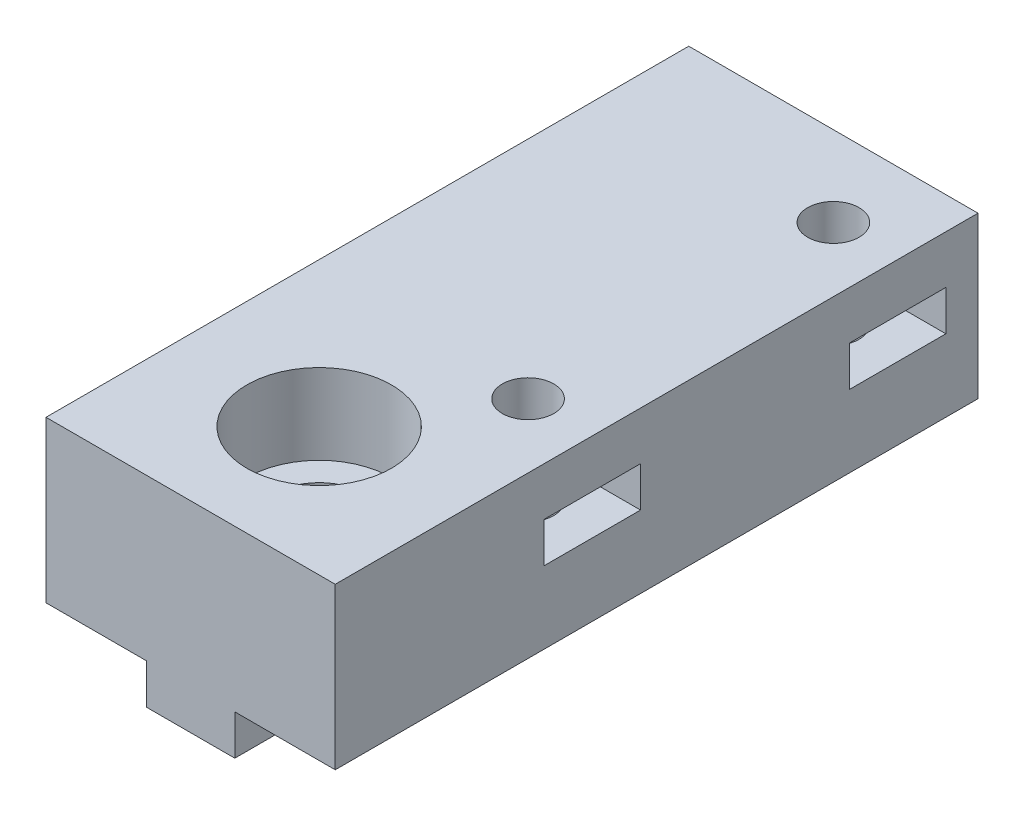
ISO-10303-21;
HEADER;
FILE_DESCRIPTION(('STEP AP214'),'2;1');
FILE_NAME('part.step','',(''),(''),'','','');
FILE_SCHEMA(('AUTOMOTIVE_DESIGN { 1 0 10303 214 1 1 1 1 }'));
ENDSEC;
DATA;
#1=APPLICATION_CONTEXT('core data for automotive mechanical design processes');
#2=APPLICATION_PROTOCOL_DEFINITION('international standard','automotive_design',2000,#1);
#3=PRODUCT_CONTEXT('',#1,'mechanical');
#4=PRODUCT('Part','Part','',(#3));
#5=PRODUCT_RELATED_PRODUCT_CATEGORY('part','',(#4));
#6=PRODUCT_DEFINITION_FORMATION('','',#4);
#7=PRODUCT_DEFINITION_CONTEXT('part definition',#1,'design');
#8=PRODUCT_DEFINITION('design','',#6,#7);
#9=PRODUCT_DEFINITION_SHAPE('','',#8);
#10=(LENGTH_UNIT() NAMED_UNIT(*) SI_UNIT(.MILLI.,.METRE.));
#11=(NAMED_UNIT(*) PLANE_ANGLE_UNIT() SI_UNIT($,.RADIAN.));
#12=(NAMED_UNIT(*) SI_UNIT($,.STERADIAN.) SOLID_ANGLE_UNIT());
#13=UNCERTAINTY_MEASURE_WITH_UNIT(LENGTH_MEASURE(1.E-05),#10,'distance_accuracy_value','');
#14=(GEOMETRIC_REPRESENTATION_CONTEXT(3) GLOBAL_UNCERTAINTY_ASSIGNED_CONTEXT((#13)) GLOBAL_UNIT_ASSIGNED_CONTEXT((#10,
#11,#12)) REPRESENTATION_CONTEXT('',''));
#15=CARTESIAN_POINT('',(0.,0.,0.));
#16=DIRECTION('',(0.,0.,1.));
#17=DIRECTION('',(1.,0.,0.));
#18=AXIS2_PLACEMENT_3D('',#15,#16,#17);
#19=CARTESIAN_POINT('',(13.3032417795605,-2.5,-35.));
#20=DIRECTION('',(0.,1.,0.));
#21=DIRECTION('',(0.,0.,1.));
#22=AXIS2_PLACEMENT_3D('',#19,#20,#21);
#23=CYLINDRICAL_SURFACE('',#22,1.6);
#24=CARTESIAN_POINT('',(13.3032417795605,7.,-35.));
#25=DIRECTION('',(0.,1.,0.));
#26=DIRECTION('',(0.,0.,1.));
#27=AXIS2_PLACEMENT_3D('',#24,#25,#26);
#28=CIRCLE('',#27,1.6);
#29=CARTESIAN_POINT('',(13.3032417795605,7.,-33.4));
#30=VERTEX_POINT('',#29);
#31=EDGE_CURVE('E37',#30,#30,#28,.F.);
#32=ORIENTED_EDGE('',*,*,#31,.T.);
#33=EDGE_LOOP('',(#32));
#34=FACE_BOUND('',#33,.T.);
#35=CARTESIAN_POINT('',(13.3032417795605,10.,-35.));
#36=DIRECTION('',(0.,1.,0.));
#37=DIRECTION('',(0.,0.,1.));
#38=AXIS2_PLACEMENT_3D('',#35,#36,#37);
#39=CIRCLE('',#38,1.6);
#40=CARTESIAN_POINT('',(13.3032417795605,10.,-33.4));
#41=VERTEX_POINT('',#40);
#42=EDGE_CURVE('E243',#41,#41,#39,.T.);
#43=ORIENTED_EDGE('',*,*,#42,.T.);
#44=EDGE_LOOP('',(#43));
#45=FACE_BOUND('',#44,.T.);
#46=ADVANCED_FACE('F33',(#34,#45),#23,.F.);
#47=CARTESIAN_POINT('',(13.3032417795605,-2.5,-16.));
#48=DIRECTION('',(0.,1.,0.));
#49=DIRECTION('',(0.,0.,1.));
#50=AXIS2_PLACEMENT_3D('',#47,#48,#49);
#51=CYLINDRICAL_SURFACE('',#50,1.6);
#52=CARTESIAN_POINT('',(13.3032417795605,7.,-16.));
#53=DIRECTION('',(0.,1.,0.));
#54=DIRECTION('',(0.,0.,1.));
#55=AXIS2_PLACEMENT_3D('',#52,#53,#54);
#56=CIRCLE('',#55,1.6);
#57=CARTESIAN_POINT('',(13.3032417795605,7.,-14.4));
#58=VERTEX_POINT('',#57);
#59=EDGE_CURVE('E247',#58,#58,#56,.F.);
#60=ORIENTED_EDGE('',*,*,#59,.T.);
#61=EDGE_LOOP('',(#60));
#62=FACE_BOUND('',#61,.T.);
#63=CARTESIAN_POINT('',(13.3032417795605,10.,-16.));
#64=DIRECTION('',(0.,1.,0.));
#65=DIRECTION('',(0.,0.,1.));
#66=AXIS2_PLACEMENT_3D('',#63,#64,#65);
#67=CIRCLE('',#66,1.6);
#68=CARTESIAN_POINT('',(13.3032417795605,10.,-14.4));
#69=VERTEX_POINT('',#68);
#70=EDGE_CURVE('E248',#69,#69,#67,.T.);
#71=ORIENTED_EDGE('',*,*,#70,.T.);
#72=EDGE_LOOP('',(#71));
#73=FACE_BOUND('',#72,.T.);
#74=ADVANCED_FACE('F375',(#62,#73),#51,.F.);
#75=CARTESIAN_POINT('',(8.30324177956045,-2.5,-8.));
#76=DIRECTION('',(0.,1.,0.));
#77=DIRECTION('',(0.,0.,1.));
#78=AXIS2_PLACEMENT_3D('',#75,#76,#77);
#79=CYLINDRICAL_SURFACE('',#78,2.8);
#80=CARTESIAN_POINT('',(8.30324177956045,-2.5,-8.));
#81=DIRECTION('',(0.,1.,0.));
#82=DIRECTION('',(0.,0.,1.));
#83=AXIS2_PLACEMENT_3D('',#80,#81,#82);
#84=CIRCLE('',#83,2.8);
#85=CARTESIAN_POINT('',(11.0532417795605,-2.5,-8.52678268764264));
#86=VERTEX_POINT('',#85);
#87=CARTESIAN_POINT('',(5.55324177956045,-2.5,-8.52678268764265));
#88=VERTEX_POINT('',#87);
#89=EDGE_CURVE('E11',#86,#88,#84,.T.);
#90=ORIENTED_EDGE('',*,*,#89,.F.);
#91=DIRECTION('',(0.,1.,0.));
#92=VECTOR('',#91,1.);
#93=CARTESIAN_POINT('',(11.0532417795605,-2.5,-8.52678268764264));
#94=LINE('',#93,#92);
#95=CARTESIAN_POINT('',(11.0532417795605,0.,-8.52678268764264));
#96=VERTEX_POINT('',#95);
#97=EDGE_CURVE('E259',#96,#86,#94,.F.);
#98=ORIENTED_EDGE('',*,*,#97,.F.);
#99=CARTESIAN_POINT('',(8.30324177956045,0.,-8.));
#100=DIRECTION('',(0.,-1.,0.));
#101=DIRECTION('',(0.,0.,-1.));
#102=AXIS2_PLACEMENT_3D('',#99,#100,#101);
#103=CIRCLE('',#102,2.8);
#104=CARTESIAN_POINT('',(11.0532417795605,0.,-7.47321731235736));
#105=VERTEX_POINT('',#104);
#106=EDGE_CURVE('E262',#96,#105,#103,.T.);
#107=ORIENTED_EDGE('',*,*,#106,.T.);
#108=DIRECTION('',(0.,1.,0.));
#109=VECTOR('',#108,1.);
#110=CARTESIAN_POINT('',(11.0532417795605,-2.5,-7.47321731235736));
#111=LINE('',#110,#109);
#112=CARTESIAN_POINT('',(11.0532417795605,-2.5,-7.47321731235736));
#113=VERTEX_POINT('',#112);
#114=EDGE_CURVE('E264',#113,#105,#111,.T.);
#115=ORIENTED_EDGE('',*,*,#114,.F.);
#116=CARTESIAN_POINT('',(5.55324177956045,-2.5,-7.47321731235736));
#117=VERTEX_POINT('',#116);
#118=EDGE_CURVE('E42',#117,#113,#84,.T.);
#119=ORIENTED_EDGE('',*,*,#118,.F.);
#120=DIRECTION('',(0.,1.,0.));
#121=VECTOR('',#120,1.);
#122=CARTESIAN_POINT('',(5.55324177956045,-2.5,-7.47321731235736));
#123=LINE('',#122,#121);
#124=CARTESIAN_POINT('',(5.55324177956045,0.,-7.47321731235736));
#125=VERTEX_POINT('',#124);
#126=EDGE_CURVE('E267',#125,#117,#123,.F.);
#127=ORIENTED_EDGE('',*,*,#126,.F.);
#128=CARTESIAN_POINT('',(8.30324177956045,0.,-8.));
#129=DIRECTION('',(0.,-1.,0.));
#130=DIRECTION('',(0.,0.,-1.));
#131=AXIS2_PLACEMENT_3D('',#128,#129,#130);
#132=CIRCLE('',#131,2.8);
#133=CARTESIAN_POINT('',(5.55324177956045,0.,-8.52678268764265));
#134=VERTEX_POINT('',#133);
#135=EDGE_CURVE('E270',#125,#134,#132,.T.);
#136=ORIENTED_EDGE('',*,*,#135,.T.);
#137=DIRECTION('',(0.,1.,0.));
#138=VECTOR('',#137,1.);
#139=CARTESIAN_POINT('',(5.55324177956045,-2.5,-8.52678268764265));
#140=LINE('',#139,#138);
#141=EDGE_CURVE('E272',#88,#134,#140,.T.);
#142=ORIENTED_EDGE('',*,*,#141,.F.);
#143=EDGE_LOOP('',(#90,#98,#107,#115,#119,#127,#136,#142));
#144=FACE_BOUND('',#143,.T.);
#145=CARTESIAN_POINT('',(8.30324177956045,5.,-8.));
#146=DIRECTION('',(0.,1.,0.));
#147=DIRECTION('',(0.,0.,1.));
#148=AXIS2_PLACEMENT_3D('',#145,#146,#147);
#149=CIRCLE('',#148,2.8);
#150=CARTESIAN_POINT('',(8.30324177956045,5.,-5.2));
#151=VERTEX_POINT('',#150);
#152=EDGE_CURVE('E255',#151,#151,#149,.F.);
#153=ORIENTED_EDGE('',*,*,#152,.F.);
#154=EDGE_LOOP('',(#153));
#155=FACE_BOUND('',#154,.T.);
#156=ADVANCED_FACE('F381',(#144,#155),#79,.F.);
#157=CARTESIAN_POINT('',(5.55324177956045,-2.5,-40.));
#158=DIRECTION('',(1.,0.,0.));
#159=DIRECTION('',(0.,0.,-1.));
#160=AXIS2_PLACEMENT_3D('',#157,#158,#159);
#161=PLANE('',#160);
#162=DIRECTION('',(0.,0.,-1.));
#163=VECTOR('',#162,1.);
#164=CARTESIAN_POINT('',(5.55324177956045,-2.5,-40.));
#165=LINE('',#164,#163);
#166=CARTESIAN_POINT('',(5.55324177956045,-2.5,-40.));
#167=VERTEX_POINT('',#166);
#168=EDGE_CURVE('E280',#88,#167,#165,.T.);
#169=ORIENTED_EDGE('',*,*,#168,.F.);
#170=ORIENTED_EDGE('',*,*,#141,.T.);
#171=DIRECTION('',(0.,0.,-1.));
#172=VECTOR('',#171,1.);
#173=CARTESIAN_POINT('',(5.55324177956045,0.,-40.));
#174=LINE('',#173,#172);
#175=CARTESIAN_POINT('',(5.55324177956045,0.,-40.));
#176=VERTEX_POINT('',#175);
#177=EDGE_CURVE('E275',#134,#176,#174,.T.);
#178=ORIENTED_EDGE('',*,*,#177,.T.);
#179=DIRECTION('',(0.,1.,0.));
#180=VECTOR('',#179,1.);
#181=CARTESIAN_POINT('',(5.55324177956045,-2.5,-40.));
#182=LINE('',#181,#180);
#183=EDGE_CURVE('E304',#167,#176,#182,.T.);
#184=ORIENTED_EDGE('',*,*,#183,.F.);
#185=EDGE_LOOP('',(#169,#170,#178,#184));
#186=FACE_BOUND('',#185,.T.);
#187=ADVANCED_FACE('F449',(#186),#161,.F.);
#188=CARTESIAN_POINT('',(11.0532417795605,-2.5,-40.));
#189=DIRECTION('',(-1.,0.,0.));
#190=DIRECTION('',(0.,0.,1.));
#191=AXIS2_PLACEMENT_3D('',#188,#189,#190);
#192=PLANE('',#191);
#193=DIRECTION('',(0.,0.,1.));
#194=VECTOR('',#193,1.);
#195=CARTESIAN_POINT('',(11.0532417795605,-2.5,-40.));
#196=LINE('',#195,#194);
#197=CARTESIAN_POINT('',(11.0532417795605,-2.5,0.));
#198=VERTEX_POINT('',#197);
#199=EDGE_CURVE('E282',#113,#198,#196,.T.);
#200=ORIENTED_EDGE('',*,*,#199,.F.);
#201=ORIENTED_EDGE('',*,*,#114,.T.);
#202=DIRECTION('',(0.,0.,1.));
#203=VECTOR('',#202,1.);
#204=CARTESIAN_POINT('',(11.0532417795605,0.,-40.));
#205=LINE('',#204,#203);
#206=CARTESIAN_POINT('',(11.0532417795605,0.,0.));
#207=VERTEX_POINT('',#206);
#208=EDGE_CURVE('E292',#105,#207,#205,.T.);
#209=ORIENTED_EDGE('',*,*,#208,.T.);
#210=DIRECTION('',(0.,1.,0.));
#211=VECTOR('',#210,1.);
#212=CARTESIAN_POINT('',(11.0532417795605,-2.5,0.));
#213=LINE('',#212,#211);
#214=EDGE_CURVE('E298',#198,#207,#213,.T.);
#215=ORIENTED_EDGE('',*,*,#214,.F.);
#216=EDGE_LOOP('',(#200,#201,#209,#215));
#217=FACE_BOUND('',#216,.T.);
#218=ADVANCED_FACE('F436',(#217),#192,.F.);
#219=CARTESIAN_POINT('',(0.,-2.5,0.));
#220=DIRECTION('',(0.,1.,0.));
#221=DIRECTION('',(0.,0.,1.));
#222=AXIS2_PLACEMENT_3D('',#219,#220,#221);
#223=PLANE('',#222);
#224=CARTESIAN_POINT('',(11.0532417795605,-2.5,-40.));
#225=VERTEX_POINT('',#224);
#226=EDGE_CURVE('E283',#225,#86,#196,.T.);
#227=ORIENTED_EDGE('',*,*,#226,.T.);
#228=ORIENTED_EDGE('',*,*,#89,.T.);
#229=ORIENTED_EDGE('',*,*,#168,.T.);
#230=DIRECTION('',(1.,0.,0.));
#231=VECTOR('',#230,1.);
#232=CARTESIAN_POINT('',(5.55324177956045,-2.5,-40.));
#233=LINE('',#232,#231);
#234=EDGE_CURVE('E279',#167,#225,#233,.T.);
#235=ORIENTED_EDGE('',*,*,#234,.T.);
#236=EDGE_LOOP('',(#227,#228,#229,#235));
#237=FACE_BOUND('',#236,.T.);
#238=ADVANCED_FACE('F451',(#237),#223,.F.);
#239=CARTESIAN_POINT('',(0.,0.,0.));
#240=DIRECTION('',(0.,-1.,0.));
#241=DIRECTION('',(0.,0.,-1.));
#242=AXIS2_PLACEMENT_3D('',#239,#240,#241);
#243=PLANE('',#242);
#244=ORIENTED_EDGE('',*,*,#135,.F.);
#245=CARTESIAN_POINT('',(5.55324177956045,0.,0.));
#246=VERTEX_POINT('',#245);
#247=EDGE_CURVE('E289',#246,#125,#174,.T.);
#248=ORIENTED_EDGE('',*,*,#247,.F.);
#249=DIRECTION('',(1.,0.,0.));
#250=VECTOR('',#249,1.);
#251=CARTESIAN_POINT('',(-0.696758220439547,0.,0.));
#252=LINE('',#251,#250);
#253=CARTESIAN_POINT('',(-0.696758220439547,0.,0.));
#254=VERTEX_POINT('',#253);
#255=EDGE_CURVE('E322',#254,#246,#252,.T.);
#256=ORIENTED_EDGE('',*,*,#255,.F.);
#257=DIRECTION('',(0.,0.,1.));
#258=VECTOR('',#257,1.);
#259=CARTESIAN_POINT('',(-0.696758220439547,0.,0.));
#260=LINE('',#259,#258);
#261=CARTESIAN_POINT('',(-0.696758220439547,0.,-40.));
#262=VERTEX_POINT('',#261);
#263=EDGE_CURVE('E307',#262,#254,#260,.T.);
#264=ORIENTED_EDGE('',*,*,#263,.F.);
#265=DIRECTION('',(-1.,0.,0.));
#266=VECTOR('',#265,1.);
#267=CARTESIAN_POINT('',(-0.696758220439547,0.,-40.));
#268=LINE('',#267,#266);
#269=EDGE_CURVE('E327',#176,#262,#268,.T.);
#270=ORIENTED_EDGE('',*,*,#269,.F.);
#271=ORIENTED_EDGE('',*,*,#177,.F.);
#272=EDGE_LOOP('',(#244,#248,#256,#264,#270,#271));
#273=FACE_BOUND('',#272,.T.);
#274=ADVANCED_FACE('F406',(#273),#243,.T.);
#275=CARTESIAN_POINT('',(-0.696758220439547,10.,0.));
#276=DIRECTION('',(1.,0.,0.));
#277=DIRECTION('',(0.,0.,-1.));
#278=AXIS2_PLACEMENT_3D('',#275,#276,#277);
#279=PLANE('',#278);
#280=ORIENTED_EDGE('',*,*,#263,.T.);
#281=DIRECTION('',(0.,-1.,0.));
#282=VECTOR('',#281,1.);
#283=CARTESIAN_POINT('',(-0.696758220439547,10.,0.));
#284=LINE('',#283,#282);
#285=CARTESIAN_POINT('',(-0.696758220439547,10.,0.));
#286=VERTEX_POINT('',#285);
#287=EDGE_CURVE('E338',#286,#254,#284,.T.);
#288=ORIENTED_EDGE('',*,*,#287,.F.);
#289=DIRECTION('',(0.,0.,1.));
#290=VECTOR('',#289,1.);
#291=CARTESIAN_POINT('',(-0.696758220439547,10.,0.));
#292=LINE('',#291,#290);
#293=CARTESIAN_POINT('',(-0.696758220439547,10.,-40.));
#294=VERTEX_POINT('',#293);
#295=EDGE_CURVE('E308',#294,#286,#292,.T.);
#296=ORIENTED_EDGE('',*,*,#295,.F.);
#297=DIRECTION('',(0.,-1.,0.));
#298=VECTOR('',#297,1.);
#299=CARTESIAN_POINT('',(-0.696758220439547,10.,-40.));
#300=LINE('',#299,#298);
#301=EDGE_CURVE('E318',#294,#262,#300,.T.);
#302=ORIENTED_EDGE('',*,*,#301,.T.);
#303=EDGE_LOOP('',(#280,#288,#296,#302));
#304=FACE_BOUND('',#303,.T.);
#305=ADVANCED_FACE('F35',(#304),#279,.F.);
#306=CARTESIAN_POINT('',(-0.696758220439547,10.,0.));
#307=DIRECTION('',(0.,0.,-1.));
#308=DIRECTION('',(-1.,0.,0.));
#309=AXIS2_PLACEMENT_3D('',#306,#307,#308);
#310=PLANE('',#309);
#311=ORIENTED_EDGE('',*,*,#255,.T.);
#312=DIRECTION('',(0.,1.,0.));
#313=VECTOR('',#312,1.);
#314=CARTESIAN_POINT('',(5.55324177956045,-2.5,0.));
#315=LINE('',#314,#313);
#316=CARTESIAN_POINT('',(5.55324177956045,-2.5,0.));
#317=VERTEX_POINT('',#316);
#318=EDGE_CURVE('E288',#317,#246,#315,.T.);
#319=ORIENTED_EDGE('',*,*,#318,.F.);
#320=DIRECTION('',(-1.,0.,0.));
#321=VECTOR('',#320,1.);
#322=CARTESIAN_POINT('',(5.55324177956045,-2.5,0.));
#323=LINE('',#322,#321);
#324=EDGE_CURVE('E286',#198,#317,#323,.T.);
#325=ORIENTED_EDGE('',*,*,#324,.F.);
#326=ORIENTED_EDGE('',*,*,#214,.T.);
#327=CARTESIAN_POINT('',(17.3032417795605,0.,0.));
#328=VERTEX_POINT('',#327);
#329=EDGE_CURVE('E321',#207,#328,#252,.T.);
#330=ORIENTED_EDGE('',*,*,#329,.T.);
#331=DIRECTION('',(0.,-1.,0.));
#332=VECTOR('',#331,1.);
#333=CARTESIAN_POINT('',(17.3032417795605,10.,0.));
#334=LINE('',#333,#332);
#335=CARTESIAN_POINT('',(17.3032417795605,10.,0.));
#336=VERTEX_POINT('',#335);
#337=EDGE_CURVE('E335',#336,#328,#334,.T.);
#338=ORIENTED_EDGE('',*,*,#337,.F.);
#339=DIRECTION('',(1.,0.,0.));
#340=VECTOR('',#339,1.);
#341=CARTESIAN_POINT('',(-0.696758220439547,10.,0.));
#342=LINE('',#341,#340);
#343=EDGE_CURVE('E311',#286,#336,#342,.T.);
#344=ORIENTED_EDGE('',*,*,#343,.F.);
#345=ORIENTED_EDGE('',*,*,#287,.T.);
#346=EDGE_LOOP('',(#311,#319,#325,#326,#330,#338,#344,#345));
#347=FACE_BOUND('',#346,.T.);
#348=ADVANCED_FACE('F430',(#347),#310,.F.);
#349=CARTESIAN_POINT('',(17.3032417795605,10.,0.));
#350=DIRECTION('',(-1.,0.,0.));
#351=DIRECTION('',(0.,0.,1.));
#352=AXIS2_PLACEMENT_3D('',#349,#350,#351);
#353=PLANE('',#352);
#354=DIRECTION('',(0.,0.,-1.));
#355=VECTOR('',#354,1.);
#356=CARTESIAN_POINT('',(17.3032417795605,4.5,-32.));
#357=LINE('',#356,#355);
#358=CARTESIAN_POINT('',(17.3032417795605,4.5,-32.));
#359=VERTEX_POINT('',#358);
#360=CARTESIAN_POINT('',(17.3032417795605,4.5,-38.));
#361=VERTEX_POINT('',#360);
#362=EDGE_CURVE('E202',#359,#361,#357,.T.);
#363=ORIENTED_EDGE('',*,*,#362,.F.);
#364=DIRECTION('',(0.,-1.,0.));
#365=VECTOR('',#364,1.);
#366=CARTESIAN_POINT('',(17.3032417795605,7.,-32.));
#367=LINE('',#366,#365);
#368=CARTESIAN_POINT('',(17.3032417795605,7.,-32.));
#369=VERTEX_POINT('',#368);
#370=EDGE_CURVE('E50',#369,#359,#367,.T.);
#371=ORIENTED_EDGE('',*,*,#370,.F.);
#372=DIRECTION('',(0.,0.,1.));
#373=VECTOR('',#372,1.);
#374=CARTESIAN_POINT('',(17.3032417795605,7.,-32.));
#375=LINE('',#374,#373);
#376=CARTESIAN_POINT('',(17.3032417795605,7.,-38.));
#377=VERTEX_POINT('',#376);
#378=EDGE_CURVE('E193',#377,#369,#375,.T.);
#379=ORIENTED_EDGE('',*,*,#378,.F.);
#380=DIRECTION('',(0.,1.,0.));
#381=VECTOR('',#380,1.);
#382=CARTESIAN_POINT('',(17.3032417795605,7.,-38.));
#383=LINE('',#382,#381);
#384=EDGE_CURVE('E196',#361,#377,#383,.T.);
#385=ORIENTED_EDGE('',*,*,#384,.F.);
#386=EDGE_LOOP('',(#363,#371,#379,#385));
#387=FACE_BOUND('',#386,.T.);
#388=DIRECTION('',(0.,0.,-1.));
#389=VECTOR('',#388,1.);
#390=CARTESIAN_POINT('',(17.3032417795605,4.5,-13.));
#391=LINE('',#390,#389);
#392=CARTESIAN_POINT('',(17.3032417795605,4.5,-13.));
#393=VERTEX_POINT('',#392);
#394=CARTESIAN_POINT('',(17.3032417795605,4.5,-19.));
#395=VERTEX_POINT('',#394);
#396=EDGE_CURVE('E227',#393,#395,#391,.T.);
#397=ORIENTED_EDGE('',*,*,#396,.F.);
#398=DIRECTION('',(0.,-1.,0.));
#399=VECTOR('',#398,1.);
#400=CARTESIAN_POINT('',(17.3032417795605,7.,-13.));
#401=LINE('',#400,#399);
#402=CARTESIAN_POINT('',(17.3032417795605,7.,-13.));
#403=VERTEX_POINT('',#402);
#404=EDGE_CURVE('E58',#403,#393,#401,.T.);
#405=ORIENTED_EDGE('',*,*,#404,.F.);
#406=DIRECTION('',(0.,0.,1.));
#407=VECTOR('',#406,1.);
#408=CARTESIAN_POINT('',(17.3032417795605,7.,-13.));
#409=LINE('',#408,#407);
#410=CARTESIAN_POINT('',(17.3032417795605,7.,-19.));
#411=VERTEX_POINT('',#410);
#412=EDGE_CURVE('E216',#411,#403,#409,.T.);
#413=ORIENTED_EDGE('',*,*,#412,.F.);
#414=DIRECTION('',(0.,1.,0.));
#415=VECTOR('',#414,1.);
#416=CARTESIAN_POINT('',(17.3032417795605,7.,-19.));
#417=LINE('',#416,#415);
#418=EDGE_CURVE('E230',#395,#411,#417,.T.);
#419=ORIENTED_EDGE('',*,*,#418,.F.);
#420=EDGE_LOOP('',(#397,#405,#413,#419));
#421=FACE_BOUND('',#420,.T.);
#422=DIRECTION('',(0.,0.,-1.));
#423=VECTOR('',#422,1.);
#424=CARTESIAN_POINT('',(17.3032417795605,0.,0.));
#425=LINE('',#424,#423);
#426=CARTESIAN_POINT('',(17.3032417795605,0.,-40.));
#427=VERTEX_POINT('',#426);
#428=EDGE_CURVE('E325',#328,#427,#425,.T.);
#429=ORIENTED_EDGE('',*,*,#428,.T.);
#430=DIRECTION('',(0.,-1.,0.));
#431=VECTOR('',#430,1.);
#432=CARTESIAN_POINT('',(17.3032417795605,10.,-40.));
#433=LINE('',#432,#431);
#434=CARTESIAN_POINT('',(17.3032417795605,10.,-40.));
#435=VERTEX_POINT('',#434);
#436=EDGE_CURVE('E332',#435,#427,#433,.T.);
#437=ORIENTED_EDGE('',*,*,#436,.F.);
#438=DIRECTION('',(0.,0.,-1.));
#439=VECTOR('',#438,1.);
#440=CARTESIAN_POINT('',(17.3032417795605,10.,0.));
#441=LINE('',#440,#439);
#442=EDGE_CURVE('E314',#336,#435,#441,.T.);
#443=ORIENTED_EDGE('',*,*,#442,.F.);
#444=ORIENTED_EDGE('',*,*,#337,.T.);
#445=EDGE_LOOP('',(#429,#437,#443,#444));
#446=FACE_BOUND('',#445,.T.);
#447=ADVANCED_FACE('F426',(#387,#421,#446),#353,.F.);
#448=CARTESIAN_POINT('',(-0.696758220439547,10.,-40.));
#449=DIRECTION('',(0.,0.,1.));
#450=DIRECTION('',(1.,0.,0.));
#451=AXIS2_PLACEMENT_3D('',#448,#449,#450);
#452=PLANE('',#451);
#453=CARTESIAN_POINT('',(11.0532417795605,0.,-40.));
#454=VERTEX_POINT('',#453);
#455=EDGE_CURVE('E312',#427,#454,#268,.T.);
#456=ORIENTED_EDGE('',*,*,#455,.T.);
#457=DIRECTION('',(0.,1.,0.));
#458=VECTOR('',#457,1.);
#459=CARTESIAN_POINT('',(11.0532417795605,-2.5,-40.));
#460=LINE('',#459,#458);
#461=EDGE_CURVE('E301',#225,#454,#460,.T.);
#462=ORIENTED_EDGE('',*,*,#461,.F.);
#463=ORIENTED_EDGE('',*,*,#234,.F.);
#464=ORIENTED_EDGE('',*,*,#183,.T.);
#465=ORIENTED_EDGE('',*,*,#269,.T.);
#466=ORIENTED_EDGE('',*,*,#301,.F.);
#467=DIRECTION('',(-1.,0.,0.));
#468=VECTOR('',#467,1.);
#469=CARTESIAN_POINT('',(-0.696758220439547,10.,-40.));
#470=LINE('',#469,#468);
#471=EDGE_CURVE('E316',#435,#294,#470,.T.);
#472=ORIENTED_EDGE('',*,*,#471,.F.);
#473=ORIENTED_EDGE('',*,*,#436,.T.);
#474=EDGE_LOOP('',(#456,#462,#463,#464,#465,#466,#472,#473));
#475=FACE_BOUND('',#474,.T.);
#476=ADVANCED_FACE('F420',(#475),#452,.F.);
#477=CARTESIAN_POINT('',(0.,10.,0.));
#478=DIRECTION('',(0.,-1.,0.));
#479=DIRECTION('',(0.,0.,-1.));
#480=AXIS2_PLACEMENT_3D('',#477,#478,#479);
#481=PLANE('',#480);
#482=ORIENTED_EDGE('',*,*,#42,.F.);
#483=EDGE_LOOP('',(#482));
#484=FACE_BOUND('',#483,.T.);
#485=ORIENTED_EDGE('',*,*,#70,.F.);
#486=EDGE_LOOP('',(#485));
#487=FACE_BOUND('',#486,.T.);
#488=CARTESIAN_POINT('',(8.30324177956045,10.,-8.));
#489=DIRECTION('',(0.,1.,0.));
#490=DIRECTION('',(0.,0.,1.));
#491=AXIS2_PLACEMENT_3D('',#488,#489,#490);
#492=CIRCLE('',#491,4.5);
#493=CARTESIAN_POINT('',(8.30324177956045,10.,-3.5));
#494=VERTEX_POINT('',#493);
#495=EDGE_CURVE('E256',#494,#494,#492,.T.);
#496=ORIENTED_EDGE('',*,*,#495,.F.);
#497=EDGE_LOOP('',(#496));
#498=FACE_BOUND('',#497,.T.);
#499=ORIENTED_EDGE('',*,*,#295,.T.);
#500=ORIENTED_EDGE('',*,*,#343,.T.);
#501=ORIENTED_EDGE('',*,*,#442,.T.);
#502=ORIENTED_EDGE('',*,*,#471,.T.);
#503=EDGE_LOOP('',(#499,#500,#501,#502));
#504=FACE_BOUND('',#503,.T.);
#505=ADVANCED_FACE('F404',(#484,#487,#498,#504),#481,.F.);
#506=CARTESIAN_POINT('',(13.3032417795605,0.,-35.));
#507=DIRECTION('',(0.,-1.,0.));
#508=DIRECTION('',(0.,0.,-1.));
#509=AXIS2_PLACEMENT_3D('',#506,#507,#508);
#510=CIRCLE('',#509,1.6);
#511=CARTESIAN_POINT('',(13.3032417795605,0.,-36.6));
#512=VERTEX_POINT('',#511);
#513=EDGE_CURVE('E246',#512,#512,#510,.T.);
#514=ORIENTED_EDGE('',*,*,#513,.F.);
#515=EDGE_LOOP('',(#514));
#516=FACE_BOUND('',#515,.T.);
#517=CARTESIAN_POINT('',(13.3032417795605,0.,-16.));
#518=DIRECTION('',(0.,-1.,0.));
#519=DIRECTION('',(0.,0.,-1.));
#520=AXIS2_PLACEMENT_3D('',#517,#518,#519);
#521=CIRCLE('',#520,1.6);
#522=CARTESIAN_POINT('',(13.3032417795605,0.,-17.6));
#523=VERTEX_POINT('',#522);
#524=EDGE_CURVE('E251',#523,#523,#521,.T.);
#525=ORIENTED_EDGE('',*,*,#524,.F.);
#526=EDGE_LOOP('',(#525));
#527=FACE_BOUND('',#526,.T.);
#528=ORIENTED_EDGE('',*,*,#106,.F.);
#529=EDGE_CURVE('E293',#454,#96,#205,.T.);
#530=ORIENTED_EDGE('',*,*,#529,.F.);
#531=ORIENTED_EDGE('',*,*,#455,.F.);
#532=ORIENTED_EDGE('',*,*,#428,.F.);
#533=ORIENTED_EDGE('',*,*,#329,.F.);
#534=ORIENTED_EDGE('',*,*,#208,.F.);
#535=EDGE_LOOP('',(#528,#530,#531,#532,#533,#534));
#536=FACE_BOUND('',#535,.T.);
#537=ADVANCED_FACE('F400',(#516,#527,#536),#243,.T.);
#538=ORIENTED_EDGE('',*,*,#247,.T.);
#539=ORIENTED_EDGE('',*,*,#126,.T.);
#540=EDGE_CURVE('E276',#317,#117,#165,.T.);
#541=ORIENTED_EDGE('',*,*,#540,.F.);
#542=ORIENTED_EDGE('',*,*,#318,.T.);
#543=EDGE_LOOP('',(#538,#539,#541,#542));
#544=FACE_BOUND('',#543,.T.);
#545=ADVANCED_FACE('F403',(#544),#161,.F.);
#546=ORIENTED_EDGE('',*,*,#529,.T.);
#547=ORIENTED_EDGE('',*,*,#97,.T.);
#548=ORIENTED_EDGE('',*,*,#226,.F.);
#549=ORIENTED_EDGE('',*,*,#461,.T.);
#550=EDGE_LOOP('',(#546,#547,#548,#549));
#551=FACE_BOUND('',#550,.T.);
#552=ADVANCED_FACE('F415',(#551),#192,.F.);
#553=ORIENTED_EDGE('',*,*,#540,.T.);
#554=ORIENTED_EDGE('',*,*,#118,.T.);
#555=ORIENTED_EDGE('',*,*,#199,.T.);
#556=ORIENTED_EDGE('',*,*,#324,.T.);
#557=EDGE_LOOP('',(#553,#554,#555,#556));
#558=FACE_BOUND('',#557,.T.);
#559=ADVANCED_FACE('F439',(#558),#223,.F.);
#560=CARTESIAN_POINT('',(8.30324177956045,5.,-8.));
#561=DIRECTION('',(0.,1.,0.));
#562=DIRECTION('',(0.,0.,1.));
#563=AXIS2_PLACEMENT_3D('',#560,#561,#562);
#564=PLANE('',#563);
#565=CARTESIAN_POINT('',(8.30324177956045,5.,-8.));
#566=DIRECTION('',(0.,1.,0.));
#567=DIRECTION('',(0.,0.,1.));
#568=AXIS2_PLACEMENT_3D('',#565,#566,#567);
#569=CIRCLE('',#568,4.5);
#570=CARTESIAN_POINT('',(8.30324177956045,5.,-3.5));
#571=VERTEX_POINT('',#570);
#572=EDGE_CURVE('E252',#571,#571,#569,.T.);
#573=ORIENTED_EDGE('',*,*,#572,.T.);
#574=EDGE_LOOP('',(#573));
#575=FACE_BOUND('',#574,.T.);
#576=ORIENTED_EDGE('',*,*,#152,.T.);
#577=EDGE_LOOP('',(#576));
#578=FACE_BOUND('',#577,.T.);
#579=ADVANCED_FACE('F461',(#575,#578),#564,.T.);
#580=CARTESIAN_POINT('',(8.30324177956045,5.,-8.));
#581=DIRECTION('',(0.,1.,0.));
#582=DIRECTION('',(0.,0.,1.));
#583=AXIS2_PLACEMENT_3D('',#580,#581,#582);
#584=CYLINDRICAL_SURFACE('',#583,4.5);
#585=ORIENTED_EDGE('',*,*,#572,.F.);
#586=EDGE_LOOP('',(#585));
#587=FACE_BOUND('',#586,.T.);
#588=ORIENTED_EDGE('',*,*,#495,.T.);
#589=EDGE_LOOP('',(#588));
#590=FACE_BOUND('',#589,.T.);
#591=ADVANCED_FACE('F395',(#587,#590),#584,.F.);
#592=CARTESIAN_POINT('',(13.3032417795605,4.5,-16.));
#593=DIRECTION('',(0.,-1.,0.));
#594=DIRECTION('',(0.,0.,-1.));
#595=AXIS2_PLACEMENT_3D('',#592,#593,#594);
#596=CIRCLE('',#595,1.6);
#597=CARTESIAN_POINT('',(13.3032417795605,4.5,-17.6));
#598=VERTEX_POINT('',#597);
#599=EDGE_CURVE('E237',#598,#598,#596,.F.);
#600=ORIENTED_EDGE('',*,*,#599,.T.);
#601=EDGE_LOOP('',(#600));
#602=FACE_BOUND('',#601,.T.);
#603=ORIENTED_EDGE('',*,*,#524,.T.);
#604=EDGE_LOOP('',(#603));
#605=FACE_BOUND('',#604,.T.);
#606=ADVANCED_FACE('F384',(#602,#605),#51,.F.);
#607=CARTESIAN_POINT('',(13.3032417795605,4.5,-35.));
#608=DIRECTION('',(0.,-1.,0.));
#609=DIRECTION('',(0.,0.,-1.));
#610=AXIS2_PLACEMENT_3D('',#607,#608,#609);
#611=CIRCLE('',#610,1.6);
#612=CARTESIAN_POINT('',(13.3032417795605,4.5,-36.6));
#613=VERTEX_POINT('',#612);
#614=EDGE_CURVE('E208',#613,#613,#611,.F.);
#615=ORIENTED_EDGE('',*,*,#614,.T.);
#616=EDGE_LOOP('',(#615));
#617=FACE_BOUND('',#616,.T.);
#618=ORIENTED_EDGE('',*,*,#513,.T.);
#619=EDGE_LOOP('',(#618));
#620=FACE_BOUND('',#619,.T.);
#621=ADVANCED_FACE('F377',(#617,#620),#23,.F.);
#622=CARTESIAN_POINT('',(9.30324177956045,7.,-13.));
#623=DIRECTION('',(0.,1.,0.));
#624=DIRECTION('',(0.,0.,1.));
#625=AXIS2_PLACEMENT_3D('',#622,#623,#624);
#626=PLANE('',#625);
#627=ORIENTED_EDGE('',*,*,#412,.T.);
#628=DIRECTION('',(1.,0.,0.));
#629=VECTOR('',#628,1.);
#630=CARTESIAN_POINT('',(9.30324177956045,7.,-13.));
#631=LINE('',#630,#629);
#632=CARTESIAN_POINT('',(9.30324177956045,7.,-13.));
#633=VERTEX_POINT('',#632);
#634=EDGE_CURVE('E235',#633,#403,#631,.T.);
#635=ORIENTED_EDGE('',*,*,#634,.F.);
#636=DIRECTION('',(0.,0.,1.));
#637=VECTOR('',#636,1.);
#638=CARTESIAN_POINT('',(9.30324177956045,7.,-13.));
#639=LINE('',#638,#637);
#640=CARTESIAN_POINT('',(9.30324177956045,7.,-19.));
#641=VERTEX_POINT('',#640);
#642=EDGE_CURVE('E222',#641,#633,#639,.T.);
#643=ORIENTED_EDGE('',*,*,#642,.F.);
#644=DIRECTION('',(1.,0.,0.));
#645=VECTOR('',#644,1.);
#646=CARTESIAN_POINT('',(9.30324177956045,7.,-19.));
#647=LINE('',#646,#645);
#648=EDGE_CURVE('E238',#641,#411,#647,.T.);
#649=ORIENTED_EDGE('',*,*,#648,.T.);
#650=EDGE_LOOP('',(#627,#635,#643,#649));
#651=FACE_BOUND('',#650,.T.);
#652=ORIENTED_EDGE('',*,*,#59,.F.);
#653=EDGE_LOOP('',(#652));
#654=FACE_BOUND('',#653,.T.);
#655=ADVANCED_FACE('F387',(#651,#654),#626,.F.);
#656=CARTESIAN_POINT('',(9.30324177956045,4.5,-13.));
#657=DIRECTION('',(0.,-1.,0.));
#658=DIRECTION('',(0.,0.,-1.));
#659=AXIS2_PLACEMENT_3D('',#656,#657,#658);
#660=PLANE('',#659);
#661=ORIENTED_EDGE('',*,*,#396,.T.);
#662=DIRECTION('',(1.,0.,0.));
#663=VECTOR('',#662,1.);
#664=CARTESIAN_POINT('',(9.30324177956045,4.5,-19.));
#665=LINE('',#664,#663);
#666=CARTESIAN_POINT('',(9.30324177956045,4.5,-19.));
#667=VERTEX_POINT('',#666);
#668=EDGE_CURVE('E240',#667,#395,#665,.T.);
#669=ORIENTED_EDGE('',*,*,#668,.F.);
#670=DIRECTION('',(0.,0.,-1.));
#671=VECTOR('',#670,1.);
#672=CARTESIAN_POINT('',(9.30324177956045,4.5,-13.));
#673=LINE('',#672,#671);
#674=CARTESIAN_POINT('',(9.30324177956045,4.5,-13.));
#675=VERTEX_POINT('',#674);
#676=EDGE_CURVE('E215',#675,#667,#673,.T.);
#677=ORIENTED_EDGE('',*,*,#676,.F.);
#678=DIRECTION('',(1.,0.,0.));
#679=VECTOR('',#678,1.);
#680=CARTESIAN_POINT('',(9.30324177956045,4.5,-13.));
#681=LINE('',#680,#679);
#682=EDGE_CURVE('E225',#675,#393,#681,.T.);
#683=ORIENTED_EDGE('',*,*,#682,.T.);
#684=EDGE_LOOP('',(#661,#669,#677,#683));
#685=FACE_BOUND('',#684,.T.);
#686=ORIENTED_EDGE('',*,*,#599,.F.);
#687=EDGE_LOOP('',(#686));
#688=FACE_BOUND('',#687,.T.);
#689=ADVANCED_FACE('F392',(#685,#688),#660,.F.);
#690=CARTESIAN_POINT('',(9.30324177956045,7.,-13.));
#691=DIRECTION('',(0.,0.,1.));
#692=DIRECTION('',(0.,-1.,0.));
#693=AXIS2_PLACEMENT_3D('',#690,#691,#692);
#694=PLANE('',#693);
#695=ORIENTED_EDGE('',*,*,#404,.T.);
#696=ORIENTED_EDGE('',*,*,#682,.F.);
#697=DIRECTION('',(0.,-1.,0.));
#698=VECTOR('',#697,1.);
#699=CARTESIAN_POINT('',(9.30324177956045,7.,-13.));
#700=LINE('',#699,#698);
#701=EDGE_CURVE('E212',#633,#675,#700,.T.);
#702=ORIENTED_EDGE('',*,*,#701,.F.);
#703=ORIENTED_EDGE('',*,*,#634,.T.);
#704=EDGE_LOOP('',(#695,#696,#702,#703));
#705=FACE_BOUND('',#704,.T.);
#706=ADVANCED_FACE('F593',(#705),#694,.F.);
#707=CARTESIAN_POINT('',(9.30324177956045,7.,-19.));
#708=DIRECTION('',(0.,0.,-1.));
#709=DIRECTION('',(0.,1.,0.));
#710=AXIS2_PLACEMENT_3D('',#707,#708,#709);
#711=PLANE('',#710);
#712=ORIENTED_EDGE('',*,*,#418,.T.);
#713=ORIENTED_EDGE('',*,*,#648,.F.);
#714=DIRECTION('',(0.,1.,0.));
#715=VECTOR('',#714,1.);
#716=CARTESIAN_POINT('',(9.30324177956045,7.,-19.));
#717=LINE('',#716,#715);
#718=EDGE_CURVE('E219',#667,#641,#717,.T.);
#719=ORIENTED_EDGE('',*,*,#718,.F.);
#720=ORIENTED_EDGE('',*,*,#668,.T.);
#721=EDGE_LOOP('',(#712,#713,#719,#720));
#722=FACE_BOUND('',#721,.T.);
#723=ADVANCED_FACE('F369',(#722),#711,.F.);
#724=CARTESIAN_POINT('',(9.30324177956045,0.,0.));
#725=DIRECTION('',(1.,0.,0.));
#726=DIRECTION('',(0.,0.,-1.));
#727=AXIS2_PLACEMENT_3D('',#724,#725,#726);
#728=PLANE('',#727);
#729=ORIENTED_EDGE('',*,*,#701,.T.);
#730=ORIENTED_EDGE('',*,*,#676,.T.);
#731=ORIENTED_EDGE('',*,*,#718,.T.);
#732=ORIENTED_EDGE('',*,*,#642,.T.);
#733=EDGE_LOOP('',(#729,#730,#731,#732));
#734=FACE_BOUND('',#733,.T.);
#735=ADVANCED_FACE('F361',(#734),#728,.T.);
#736=CARTESIAN_POINT('',(9.30324177956045,7.,-32.));
#737=DIRECTION('',(0.,1.,0.));
#738=DIRECTION('',(0.,0.,1.));
#739=AXIS2_PLACEMENT_3D('',#736,#737,#738);
#740=PLANE('',#739);
#741=ORIENTED_EDGE('',*,*,#378,.T.);
#742=DIRECTION('',(1.,0.,0.));
#743=VECTOR('',#742,1.);
#744=CARTESIAN_POINT('',(9.30324177956045,7.,-32.));
#745=LINE('',#744,#743);
#746=CARTESIAN_POINT('',(9.30324177956045,7.,-32.));
#747=VERTEX_POINT('',#746);
#748=EDGE_CURVE('E206',#747,#369,#745,.T.);
#749=ORIENTED_EDGE('',*,*,#748,.F.);
#750=DIRECTION('',(0.,0.,1.));
#751=VECTOR('',#750,1.);
#752=CARTESIAN_POINT('',(9.30324177956045,7.,-32.));
#753=LINE('',#752,#751);
#754=CARTESIAN_POINT('',(9.30324177956045,7.,-38.));
#755=VERTEX_POINT('',#754);
#756=EDGE_CURVE('E180',#755,#747,#753,.T.);
#757=ORIENTED_EDGE('',*,*,#756,.F.);
#758=DIRECTION('',(1.,0.,0.));
#759=VECTOR('',#758,1.);
#760=CARTESIAN_POINT('',(9.30324177956045,7.,-38.));
#761=LINE('',#760,#759);
#762=EDGE_CURVE('E209',#755,#377,#761,.T.);
#763=ORIENTED_EDGE('',*,*,#762,.T.);
#764=EDGE_LOOP('',(#741,#749,#757,#763));
#765=FACE_BOUND('',#764,.T.);
#766=ORIENTED_EDGE('',*,*,#31,.F.);
#767=EDGE_LOOP('',(#766));
#768=FACE_BOUND('',#767,.T.);
#769=ADVANCED_FACE('F359',(#765,#768),#740,.F.);
#770=CARTESIAN_POINT('',(9.30324177956045,4.5,-32.));
#771=DIRECTION('',(0.,-1.,0.));
#772=DIRECTION('',(0.,0.,-1.));
#773=AXIS2_PLACEMENT_3D('',#770,#771,#772);
#774=PLANE('',#773);
#775=ORIENTED_EDGE('',*,*,#362,.T.);
#776=DIRECTION('',(1.,0.,0.));
#777=VECTOR('',#776,1.);
#778=CARTESIAN_POINT('',(9.30324177956045,4.5,-38.));
#779=LINE('',#778,#777);
#780=CARTESIAN_POINT('',(9.30324177956045,4.5,-38.));
#781=VERTEX_POINT('',#780);
#782=EDGE_CURVE('E179',#781,#361,#779,.T.);
#783=ORIENTED_EDGE('',*,*,#782,.F.);
#784=DIRECTION('',(0.,0.,-1.));
#785=VECTOR('',#784,1.);
#786=CARTESIAN_POINT('',(9.30324177956045,4.5,-32.));
#787=LINE('',#786,#785);
#788=CARTESIAN_POINT('',(9.30324177956045,4.5,-32.));
#789=VERTEX_POINT('',#788);
#790=EDGE_CURVE('E183',#789,#781,#787,.T.);
#791=ORIENTED_EDGE('',*,*,#790,.F.);
#792=DIRECTION('',(1.,0.,0.));
#793=VECTOR('',#792,1.);
#794=CARTESIAN_POINT('',(9.30324177956045,4.5,-32.));
#795=LINE('',#794,#793);
#796=EDGE_CURVE('E170',#789,#359,#795,.T.);
#797=ORIENTED_EDGE('',*,*,#796,.T.);
#798=EDGE_LOOP('',(#775,#783,#791,#797));
#799=FACE_BOUND('',#798,.T.);
#800=ORIENTED_EDGE('',*,*,#614,.F.);
#801=EDGE_LOOP('',(#800));
#802=FACE_BOUND('',#801,.T.);
#803=ADVANCED_FACE('F184',(#799,#802),#774,.F.);
#804=CARTESIAN_POINT('',(9.30324177956045,7.,-32.));
#805=DIRECTION('',(0.,0.,1.));
#806=DIRECTION('',(1.,0.,0.));
#807=AXIS2_PLACEMENT_3D('',#804,#805,#806);
#808=PLANE('',#807);
#809=ORIENTED_EDGE('',*,*,#370,.T.);
#810=ORIENTED_EDGE('',*,*,#796,.F.);
#811=DIRECTION('',(0.,-1.,0.));
#812=VECTOR('',#811,1.);
#813=CARTESIAN_POINT('',(9.30324177956045,7.,-32.));
#814=LINE('',#813,#812);
#815=EDGE_CURVE('E174',#747,#789,#814,.T.);
#816=ORIENTED_EDGE('',*,*,#815,.F.);
#817=ORIENTED_EDGE('',*,*,#748,.T.);
#818=EDGE_LOOP('',(#809,#810,#816,#817));
#819=FACE_BOUND('',#818,.T.);
#820=ADVANCED_FACE('F172',(#819),#808,.F.);
#821=CARTESIAN_POINT('',(9.30324177956045,7.,-38.));
#822=DIRECTION('',(0.,0.,-1.));
#823=DIRECTION('',(-1.,0.,0.));
#824=AXIS2_PLACEMENT_3D('',#821,#822,#823);
#825=PLANE('',#824);
#826=ORIENTED_EDGE('',*,*,#384,.T.);
#827=ORIENTED_EDGE('',*,*,#762,.F.);
#828=DIRECTION('',(0.,1.,0.));
#829=VECTOR('',#828,1.);
#830=CARTESIAN_POINT('',(9.30324177956045,7.,-38.));
#831=LINE('',#830,#829);
#832=EDGE_CURVE('E189',#781,#755,#831,.T.);
#833=ORIENTED_EDGE('',*,*,#832,.F.);
#834=ORIENTED_EDGE('',*,*,#782,.T.);
#835=EDGE_LOOP('',(#826,#827,#833,#834));
#836=FACE_BOUND('',#835,.T.);
#837=ADVANCED_FACE('F635',(#836),#825,.F.);
#838=CARTESIAN_POINT('',(9.30324177956045,0.,0.));
#839=DIRECTION('',(1.,0.,0.));
#840=DIRECTION('',(0.,0.,-1.));
#841=AXIS2_PLACEMENT_3D('',#838,#839,#840);
#842=PLANE('',#841);
#843=ORIENTED_EDGE('',*,*,#815,.T.);
#844=ORIENTED_EDGE('',*,*,#790,.T.);
#845=ORIENTED_EDGE('',*,*,#832,.T.);
#846=ORIENTED_EDGE('',*,*,#756,.T.);
#847=EDGE_LOOP('',(#843,#844,#845,#846));
#848=FACE_BOUND('',#847,.T.);
#849=ADVANCED_FACE('F191',(#848),#842,.T.);
#850=CLOSED_SHELL('',(#46,#74,#156,#187,#218,#238,#274,#305,#348,#447,#476,#505,#537,#545,#552,
#559,#579,#591,#606,#621,#655,#689,#706,#723,#735,#769,#803,#820,#837,#849));
#851=MANIFOLD_SOLID_BREP('B2',#850);
#852=ADVANCED_BREP_SHAPE_REPRESENTATION('',(#18,#851),#14);
#853=SHAPE_DEFINITION_REPRESENTATION(#9,#852);
ENDSEC;
END-ISO-10303-21;
